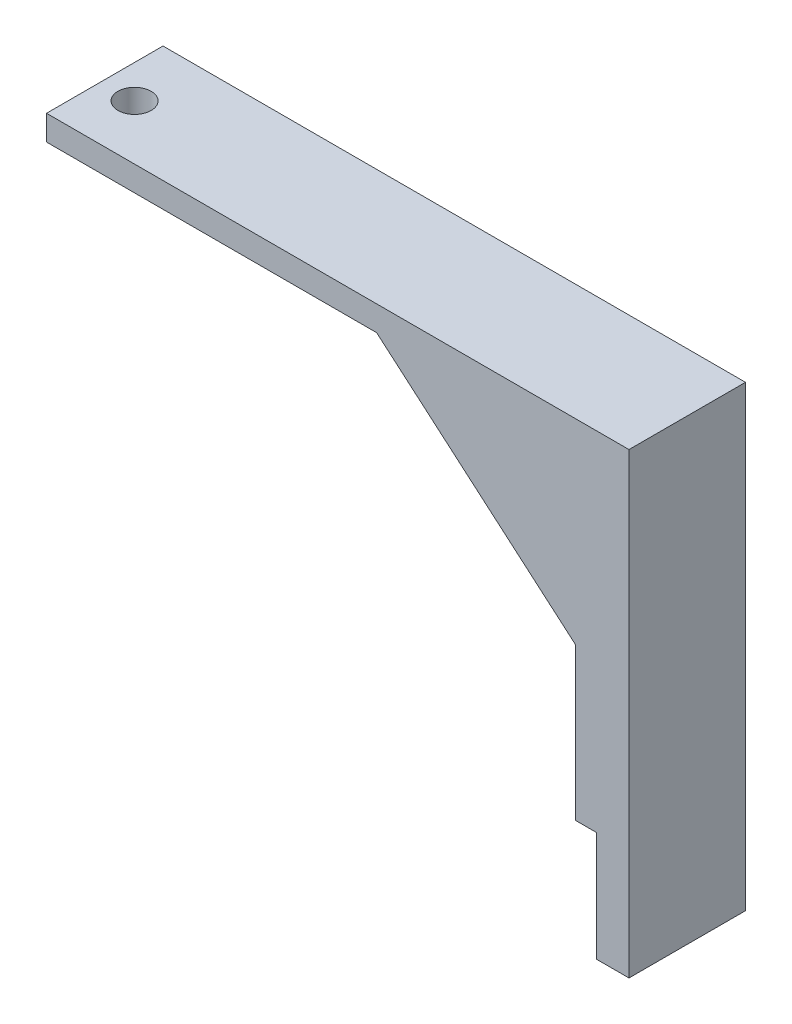
ISO-10303-21;
HEADER;
FILE_DESCRIPTION(('STEP AP214'),'2;1');
FILE_NAME('part.step','',(''),(''),'','','');
FILE_SCHEMA(('AUTOMOTIVE_DESIGN { 1 0 10303 214 1 1 1 1 }'));
ENDSEC;
DATA;
#1=APPLICATION_CONTEXT('core data for automotive mechanical design processes');
#2=APPLICATION_PROTOCOL_DEFINITION('international standard','automotive_design',2000,#1);
#3=PRODUCT_CONTEXT('',#1,'mechanical');
#4=PRODUCT('Part','Part','',(#3));
#5=PRODUCT_RELATED_PRODUCT_CATEGORY('part','',(#4));
#6=PRODUCT_DEFINITION_FORMATION('','',#4);
#7=PRODUCT_DEFINITION_CONTEXT('part definition',#1,'design');
#8=PRODUCT_DEFINITION('design','',#6,#7);
#9=PRODUCT_DEFINITION_SHAPE('','',#8);
#10=(LENGTH_UNIT() NAMED_UNIT(*) SI_UNIT(.MILLI.,.METRE.));
#11=(NAMED_UNIT(*) PLANE_ANGLE_UNIT() SI_UNIT($,.RADIAN.));
#12=(NAMED_UNIT(*) SI_UNIT($,.STERADIAN.) SOLID_ANGLE_UNIT());
#13=UNCERTAINTY_MEASURE_WITH_UNIT(LENGTH_MEASURE(1.E-05),#10,'distance_accuracy_value','');
#14=(GEOMETRIC_REPRESENTATION_CONTEXT(3) GLOBAL_UNCERTAINTY_ASSIGNED_CONTEXT((#13)) GLOBAL_UNIT_ASSIGNED_CONTEXT((#10,
#11,#12)) REPRESENTATION_CONTEXT('',''));
#15=CARTESIAN_POINT('',(0.,0.,0.));
#16=DIRECTION('',(0.,0.,1.));
#17=DIRECTION('',(1.,0.,0.));
#18=AXIS2_PLACEMENT_3D('',#15,#16,#17);
#19=CARTESIAN_POINT('',(33.8256003265712,-56.932800549661,28.));
#20=DIRECTION('',(-1.,0.,0.));
#21=DIRECTION('',(0.,0.,1.));
#22=AXIS2_PLACEMENT_3D('',#19,#20,#21);
#23=PLANE('',#22);
#24=DIRECTION('',(0.,1.,0.));
#25=VECTOR('',#24,1.);
#26=CARTESIAN_POINT('',(33.8256003265712,-56.932800549661,0.));
#27=LINE('',#26,#25);
#28=CARTESIAN_POINT('',(33.8256003265712,-56.932800549661,0.));
#29=VERTEX_POINT('',#28);
#30=CARTESIAN_POINT('',(33.8256003265712,53.067199450339,0.));
#31=VERTEX_POINT('',#30);
#32=EDGE_CURVE('E133',#29,#31,#27,.T.);
#33=ORIENTED_EDGE('',*,*,#32,.T.);
#34=DIRECTION('',(0.,0.,-1.));
#35=VECTOR('',#34,1.);
#36=CARTESIAN_POINT('',(33.8256003265712,53.067199450339,28.));
#37=LINE('',#36,#35);
#38=CARTESIAN_POINT('',(33.8256003265712,53.067199450339,28.));
#39=VERTEX_POINT('',#38);
#40=EDGE_CURVE('E11',#39,#31,#37,.T.);
#41=ORIENTED_EDGE('',*,*,#40,.F.);
#42=DIRECTION('',(0.,1.,0.));
#43=VECTOR('',#42,1.);
#44=CARTESIAN_POINT('',(33.8256003265712,-56.932800549661,28.));
#45=LINE('',#44,#43);
#46=CARTESIAN_POINT('',(33.8256003265712,-56.932800549661,28.));
#47=VERTEX_POINT('',#46);
#48=EDGE_CURVE('E149',#47,#39,#45,.T.);
#49=ORIENTED_EDGE('',*,*,#48,.F.);
#50=DIRECTION('',(0.,0.,-1.));
#51=VECTOR('',#50,1.);
#52=CARTESIAN_POINT('',(33.8256003265712,-56.932800549661,28.));
#53=LINE('',#52,#51);
#54=EDGE_CURVE('E129',#47,#29,#53,.T.);
#55=ORIENTED_EDGE('',*,*,#54,.T.);
#56=EDGE_LOOP('',(#33,#41,#49,#55));
#57=FACE_BOUND('',#56,.T.);
#58=ADVANCED_FACE('F30',(#57),#23,.F.);
#59=CARTESIAN_POINT('',(33.8256003265712,53.067199450339,28.));
#60=DIRECTION('',(0.,-1.,0.));
#61=DIRECTION('',(1.,0.,0.));
#62=AXIS2_PLACEMENT_3D('',#59,#60,#61);
#63=PLANE('',#62);
#64=CARTESIAN_POINT('',(-98.1743996734288,53.067199450339,14.8417871330366));
#65=DIRECTION('',(0.,1.,0.));
#66=DIRECTION('',(0.,0.,1.));
#67=AXIS2_PLACEMENT_3D('',#64,#65,#66);
#68=CIRCLE('',#67,4.00000000000001);
#69=CARTESIAN_POINT('',(-98.1743996734288,53.067199450339,18.8417871330366));
#70=VERTEX_POINT('',#69);
#71=EDGE_CURVE('E191',#70,#70,#68,.T.);
#72=ORIENTED_EDGE('',*,*,#71,.F.);
#73=EDGE_LOOP('',(#72));
#74=FACE_BOUND('',#73,.T.);
#75=DIRECTION('',(-1.,0.,0.));
#76=VECTOR('',#75,1.);
#77=CARTESIAN_POINT('',(33.8256003265712,53.067199450339,0.));
#78=LINE('',#77,#76);
#79=CARTESIAN_POINT('',(-106.174399673429,53.067199450339,0.));
#80=VERTEX_POINT('',#79);
#81=EDGE_CURVE('E136',#31,#80,#78,.T.);
#82=ORIENTED_EDGE('',*,*,#81,.T.);
#83=DIRECTION('',(0.,0.,-1.));
#84=VECTOR('',#83,1.);
#85=CARTESIAN_POINT('',(-106.174399673429,53.067199450339,28.));
#86=LINE('',#85,#84);
#87=CARTESIAN_POINT('',(-106.174399673429,53.067199450339,28.));
#88=VERTEX_POINT('',#87);
#89=EDGE_CURVE('E39',#88,#80,#86,.T.);
#90=ORIENTED_EDGE('',*,*,#89,.F.);
#91=DIRECTION('',(-1.,0.,0.));
#92=VECTOR('',#91,1.);
#93=CARTESIAN_POINT('',(33.8256003265712,53.067199450339,28.));
#94=LINE('',#93,#92);
#95=EDGE_CURVE('E93',#39,#88,#94,.T.);
#96=ORIENTED_EDGE('',*,*,#95,.F.);
#97=ORIENTED_EDGE('',*,*,#40,.T.);
#98=EDGE_LOOP('',(#82,#90,#96,#97));
#99=FACE_BOUND('',#98,.T.);
#100=ADVANCED_FACE('F208',(#74,#99),#63,.F.);
#101=CARTESIAN_POINT('',(-106.174399673429,53.067199450339,28.));
#102=DIRECTION('',(1.,0.,0.));
#103=DIRECTION('',(0.,0.,-1.));
#104=AXIS2_PLACEMENT_3D('',#101,#102,#103);
#105=PLANE('',#104);
#106=DIRECTION('',(0.,-1.,0.));
#107=VECTOR('',#106,1.);
#108=CARTESIAN_POINT('',(-106.174399673429,53.067199450339,0.));
#109=LINE('',#108,#107);
#110=CARTESIAN_POINT('',(-106.174399673429,47.067199450339,0.));
#111=VERTEX_POINT('',#110);
#112=EDGE_CURVE('E138',#80,#111,#109,.T.);
#113=ORIENTED_EDGE('',*,*,#112,.T.);
#114=DIRECTION('',(0.,0.,-1.));
#115=VECTOR('',#114,1.);
#116=CARTESIAN_POINT('',(-106.174399673429,47.067199450339,28.));
#117=LINE('',#116,#115);
#118=CARTESIAN_POINT('',(-106.174399673429,47.067199450339,28.));
#119=VERTEX_POINT('',#118);
#120=EDGE_CURVE('E159',#119,#111,#117,.T.);
#121=ORIENTED_EDGE('',*,*,#120,.F.);
#122=DIRECTION('',(0.,-1.,0.));
#123=VECTOR('',#122,1.);
#124=CARTESIAN_POINT('',(-106.174399673429,53.067199450339,28.));
#125=LINE('',#124,#123);
#126=EDGE_CURVE('E168',#88,#119,#125,.T.);
#127=ORIENTED_EDGE('',*,*,#126,.F.);
#128=ORIENTED_EDGE('',*,*,#89,.T.);
#129=EDGE_LOOP('',(#113,#121,#127,#128));
#130=FACE_BOUND('',#129,.T.);
#131=ADVANCED_FACE('F166',(#130),#105,.F.);
#132=CARTESIAN_POINT('',(-106.174399673429,47.067199450339,28.));
#133=DIRECTION('',(0.,1.,0.));
#134=DIRECTION('',(0.,0.,1.));
#135=AXIS2_PLACEMENT_3D('',#132,#133,#134);
#136=PLANE('',#135);
#137=CARTESIAN_POINT('',(-98.1743996734288,47.067199450339,14.8417871330366));
#138=DIRECTION('',(0.,1.,0.));
#139=DIRECTION('',(0.,0.,1.));
#140=AXIS2_PLACEMENT_3D('',#137,#138,#139);
#141=CIRCLE('',#140,4.00000000000001);
#142=CARTESIAN_POINT('',(-98.1743996734288,47.067199450339,18.8417871330366));
#143=VERTEX_POINT('',#142);
#144=EDGE_CURVE('E33',#143,#143,#141,.T.);
#145=ORIENTED_EDGE('',*,*,#144,.T.);
#146=EDGE_LOOP('',(#145));
#147=FACE_BOUND('',#146,.T.);
#148=DIRECTION('',(1.,0.,0.));
#149=VECTOR('',#148,1.);
#150=CARTESIAN_POINT('',(-106.174399673429,47.067199450339,0.));
#151=LINE('',#150,#149);
#152=CARTESIAN_POINT('',(-26.8303989073976,47.067199450339,0.));
#153=VERTEX_POINT('',#152);
#154=EDGE_CURVE('E140',#111,#153,#151,.T.);
#155=ORIENTED_EDGE('',*,*,#154,.T.);
#156=DIRECTION('',(0.,0.,-1.));
#157=VECTOR('',#156,1.);
#158=CARTESIAN_POINT('',(-26.8303989073976,47.067199450339,28.));
#159=LINE('',#158,#157);
#160=CARTESIAN_POINT('',(-26.8303989073976,47.067199450339,28.));
#161=VERTEX_POINT('',#160);
#162=EDGE_CURVE('E156',#161,#153,#159,.T.);
#163=ORIENTED_EDGE('',*,*,#162,.F.);
#164=DIRECTION('',(1.,0.,0.));
#165=VECTOR('',#164,1.);
#166=CARTESIAN_POINT('',(-106.174399673429,47.067199450339,28.));
#167=LINE('',#166,#165);
#168=EDGE_CURVE('E184',#119,#161,#167,.T.);
#169=ORIENTED_EDGE('',*,*,#168,.F.);
#170=ORIENTED_EDGE('',*,*,#120,.T.);
#171=EDGE_LOOP('',(#155,#163,#169,#170));
#172=FACE_BOUND('',#171,.T.);
#173=ADVANCED_FACE('F177',(#147,#172),#136,.F.);
#174=CARTESIAN_POINT('',(-26.8303989073976,47.067199450339,28.));
#175=DIRECTION('',(0.651409599051497,0.75872625779234,0.));
#176=DIRECTION('',(-0.75872625779234,0.651409599051497,0.));
#177=AXIS2_PLACEMENT_3D('',#174,#175,#176);
#178=PLANE('',#177);
#179=DIRECTION('',(0.75872625779234,-0.651409599051497,0.));
#180=VECTOR('',#179,1.);
#181=CARTESIAN_POINT('',(-26.8303989073976,47.067199450339,0.));
#182=LINE('',#181,#180);
#183=CARTESIAN_POINT('',(21.0192002029311,5.98560005778832,0.));
#184=VERTEX_POINT('',#183);
#185=EDGE_CURVE('E142',#153,#184,#182,.T.);
#186=ORIENTED_EDGE('',*,*,#185,.T.);
#187=DIRECTION('',(0.,0.,-1.));
#188=VECTOR('',#187,1.);
#189=CARTESIAN_POINT('',(21.0192002029311,5.98560005778832,28.));
#190=LINE('',#189,#188);
#191=CARTESIAN_POINT('',(21.0192002029311,5.98560005778832,28.));
#192=VERTEX_POINT('',#191);
#193=EDGE_CURVE('E153',#192,#184,#190,.T.);
#194=ORIENTED_EDGE('',*,*,#193,.F.);
#195=DIRECTION('',(0.75872625779234,-0.651409599051497,0.));
#196=VECTOR('',#195,1.);
#197=CARTESIAN_POINT('',(-26.8303989073976,47.067199450339,28.));
#198=LINE('',#197,#196);
#199=EDGE_CURVE('E183',#161,#192,#198,.T.);
#200=ORIENTED_EDGE('',*,*,#199,.F.);
#201=ORIENTED_EDGE('',*,*,#162,.T.);
#202=EDGE_LOOP('',(#186,#194,#200,#201));
#203=FACE_BOUND('',#202,.T.);
#204=ADVANCED_FACE('F181',(#203),#178,.F.);
#205=CARTESIAN_POINT('',(21.0192002029311,5.98560005778832,28.));
#206=DIRECTION('',(1.,0.,0.));
#207=DIRECTION('',(0.,0.,-1.));
#208=AXIS2_PLACEMENT_3D('',#205,#206,#207);
#209=PLANE('',#208);
#210=DIRECTION('',(0.,-1.,0.));
#211=VECTOR('',#210,1.);
#212=CARTESIAN_POINT('',(21.0192002029311,5.98560005778832,0.));
#213=LINE('',#212,#211);
#214=CARTESIAN_POINT('',(21.0192002029311,-30.5570829650712,0.));
#215=VERTEX_POINT('',#214);
#216=EDGE_CURVE('E144',#184,#215,#213,.T.);
#217=ORIENTED_EDGE('',*,*,#216,.T.);
#218=DIRECTION('',(0.,0.,-1.));
#219=VECTOR('',#218,1.);
#220=CARTESIAN_POINT('',(21.0192002029311,-30.5570829650712,28.));
#221=LINE('',#220,#219);
#222=CARTESIAN_POINT('',(21.0192002029311,-30.5570829650712,28.));
#223=VERTEX_POINT('',#222);
#224=EDGE_CURVE('E124',#223,#215,#221,.T.);
#225=ORIENTED_EDGE('',*,*,#224,.F.);
#226=DIRECTION('',(0.,-1.,0.));
#227=VECTOR('',#226,1.);
#228=CARTESIAN_POINT('',(21.0192002029311,5.98560005778832,28.));
#229=LINE('',#228,#227);
#230=EDGE_CURVE('E115',#192,#223,#229,.T.);
#231=ORIENTED_EDGE('',*,*,#230,.F.);
#232=ORIENTED_EDGE('',*,*,#193,.T.);
#233=EDGE_LOOP('',(#217,#225,#231,#232));
#234=FACE_BOUND('',#233,.T.);
#235=ADVANCED_FACE('F217',(#234),#209,.F.);
#236=CARTESIAN_POINT('',(21.0192002029311,-30.5570829650712,28.));
#237=DIRECTION('',(0.,1.,0.));
#238=DIRECTION('',(0.,0.,1.));
#239=AXIS2_PLACEMENT_3D('',#236,#237,#238);
#240=PLANE('',#239);
#241=DIRECTION('',(1.,0.,0.));
#242=VECTOR('',#241,1.);
#243=CARTESIAN_POINT('',(21.0192002029311,-30.5570829650712,0.));
#244=LINE('',#243,#242);
#245=CARTESIAN_POINT('',(26.0192002029311,-30.5570829650712,0.));
#246=VERTEX_POINT('',#245);
#247=EDGE_CURVE('E123',#215,#246,#244,.T.);
#248=ORIENTED_EDGE('',*,*,#247,.T.);
#249=DIRECTION('',(0.,0.,-1.));
#250=VECTOR('',#249,1.);
#251=CARTESIAN_POINT('',(26.0192002029311,-30.5570829650712,28.));
#252=LINE('',#251,#250);
#253=CARTESIAN_POINT('',(26.0192002029311,-30.5570829650712,28.));
#254=VERTEX_POINT('',#253);
#255=EDGE_CURVE('E120',#254,#246,#252,.T.);
#256=ORIENTED_EDGE('',*,*,#255,.F.);
#257=DIRECTION('',(1.,0.,0.));
#258=VECTOR('',#257,1.);
#259=CARTESIAN_POINT('',(21.0192002029311,-30.5570829650712,28.));
#260=LINE('',#259,#258);
#261=EDGE_CURVE('E109',#223,#254,#260,.T.);
#262=ORIENTED_EDGE('',*,*,#261,.F.);
#263=ORIENTED_EDGE('',*,*,#224,.T.);
#264=EDGE_LOOP('',(#248,#256,#262,#263));
#265=FACE_BOUND('',#264,.T.);
#266=ADVANCED_FACE('F121',(#265),#240,.F.);
#267=CARTESIAN_POINT('',(26.0192002029311,-30.5570829650712,28.));
#268=DIRECTION('',(1.,0.,0.));
#269=DIRECTION('',(0.,1.,0.));
#270=AXIS2_PLACEMENT_3D('',#267,#268,#269);
#271=PLANE('',#270);
#272=DIRECTION('',(0.,-1.,0.));
#273=VECTOR('',#272,1.);
#274=CARTESIAN_POINT('',(26.0192002029311,-30.5570829650712,0.));
#275=LINE('',#274,#273);
#276=CARTESIAN_POINT('',(26.0192002029311,-56.932800549661,0.));
#277=VERTEX_POINT('',#276);
#278=EDGE_CURVE('E79',#246,#277,#275,.T.);
#279=ORIENTED_EDGE('',*,*,#278,.T.);
#280=DIRECTION('',(0.,0.,-1.));
#281=VECTOR('',#280,1.);
#282=CARTESIAN_POINT('',(26.0192002029311,-56.932800549661,28.));
#283=LINE('',#282,#281);
#284=CARTESIAN_POINT('',(26.0192002029311,-56.932800549661,28.));
#285=VERTEX_POINT('',#284);
#286=EDGE_CURVE('E125',#285,#277,#283,.T.);
#287=ORIENTED_EDGE('',*,*,#286,.F.);
#288=DIRECTION('',(0.,-1.,0.));
#289=VECTOR('',#288,1.);
#290=CARTESIAN_POINT('',(26.0192002029311,-30.5570829650712,28.));
#291=LINE('',#290,#289);
#292=EDGE_CURVE('E113',#254,#285,#291,.T.);
#293=ORIENTED_EDGE('',*,*,#292,.F.);
#294=ORIENTED_EDGE('',*,*,#255,.T.);
#295=EDGE_LOOP('',(#279,#287,#293,#294));
#296=FACE_BOUND('',#295,.T.);
#297=ADVANCED_FACE('F127',(#296),#271,.F.);
#298=CARTESIAN_POINT('',(26.0192002029311,-56.932800549661,28.));
#299=DIRECTION('',(0.,1.,0.));
#300=DIRECTION('',(0.,0.,1.));
#301=AXIS2_PLACEMENT_3D('',#298,#299,#300);
#302=PLANE('',#301);
#303=DIRECTION('',(1.,0.,0.));
#304=VECTOR('',#303,1.);
#305=CARTESIAN_POINT('',(26.0192002029311,-56.932800549661,0.));
#306=LINE('',#305,#304);
#307=EDGE_CURVE('E85',#277,#29,#306,.T.);
#308=ORIENTED_EDGE('',*,*,#307,.T.);
#309=ORIENTED_EDGE('',*,*,#54,.F.);
#310=DIRECTION('',(1.,0.,0.));
#311=VECTOR('',#310,1.);
#312=CARTESIAN_POINT('',(26.0192002029311,-56.932800549661,28.));
#313=LINE('',#312,#311);
#314=EDGE_CURVE('E47',#285,#47,#313,.T.);
#315=ORIENTED_EDGE('',*,*,#314,.F.);
#316=ORIENTED_EDGE('',*,*,#286,.T.);
#317=EDGE_LOOP('',(#308,#309,#315,#316));
#318=FACE_BOUND('',#317,.T.);
#319=ADVANCED_FACE('F262',(#318),#302,.F.);
#320=CARTESIAN_POINT('',(33.8256003265712,53.067199450339,28.));
#321=DIRECTION('',(0.,0.,1.));
#322=DIRECTION('',(1.,0.,0.));
#323=AXIS2_PLACEMENT_3D('',#320,#321,#322);
#324=PLANE('',#323);
#325=ORIENTED_EDGE('',*,*,#48,.T.);
#326=ORIENTED_EDGE('',*,*,#95,.T.);
#327=ORIENTED_EDGE('',*,*,#126,.T.);
#328=ORIENTED_EDGE('',*,*,#168,.T.);
#329=ORIENTED_EDGE('',*,*,#199,.T.);
#330=ORIENTED_EDGE('',*,*,#230,.T.);
#331=ORIENTED_EDGE('',*,*,#261,.T.);
#332=ORIENTED_EDGE('',*,*,#292,.T.);
#333=ORIENTED_EDGE('',*,*,#314,.T.);
#334=EDGE_LOOP('',(#325,#326,#327,#328,#329,#330,#331,#332,#333));
#335=FACE_BOUND('',#334,.T.);
#336=ADVANCED_FACE('F111',(#335),#324,.T.);
#337=CARTESIAN_POINT('',(33.8256003265712,53.067199450339,0.));
#338=DIRECTION('',(0.,0.,1.));
#339=DIRECTION('',(1.,0.,0.));
#340=AXIS2_PLACEMENT_3D('',#337,#338,#339);
#341=PLANE('',#340);
#342=ORIENTED_EDGE('',*,*,#32,.F.);
#343=ORIENTED_EDGE('',*,*,#307,.F.);
#344=ORIENTED_EDGE('',*,*,#278,.F.);
#345=ORIENTED_EDGE('',*,*,#247,.F.);
#346=ORIENTED_EDGE('',*,*,#216,.F.);
#347=ORIENTED_EDGE('',*,*,#185,.F.);
#348=ORIENTED_EDGE('',*,*,#154,.F.);
#349=ORIENTED_EDGE('',*,*,#112,.F.);
#350=ORIENTED_EDGE('',*,*,#81,.F.);
#351=EDGE_LOOP('',(#342,#343,#344,#345,#346,#347,#348,#349,#350));
#352=FACE_BOUND('',#351,.T.);
#353=ADVANCED_FACE('F172',(#352),#341,.F.);
#354=CARTESIAN_POINT('',(-98.1743996734288,25.067199450339,14.8417871330366));
#355=DIRECTION('',(0.,1.,0.));
#356=DIRECTION('',(0.,0.,1.));
#357=AXIS2_PLACEMENT_3D('',#354,#355,#356);
#358=CYLINDRICAL_SURFACE('',#357,4.00000000000001);
#359=ORIENTED_EDGE('',*,*,#71,.T.);
#360=EDGE_LOOP('',(#359));
#361=FACE_BOUND('',#360,.T.);
#362=ORIENTED_EDGE('',*,*,#144,.F.);
#363=EDGE_LOOP('',(#362));
#364=FACE_BOUND('',#363,.T.);
#365=ADVANCED_FACE('F199',(#361,#364),#358,.F.);
#366=CLOSED_SHELL('',(#58,#100,#131,#173,#204,#235,#266,#297,#319,#336,#353,#365));
#367=MANIFOLD_SOLID_BREP('B2',#366);
#368=ADVANCED_BREP_SHAPE_REPRESENTATION('',(#18,#367),#14);
#369=SHAPE_DEFINITION_REPRESENTATION(#9,#368);
ENDSEC;
END-ISO-10303-21;
